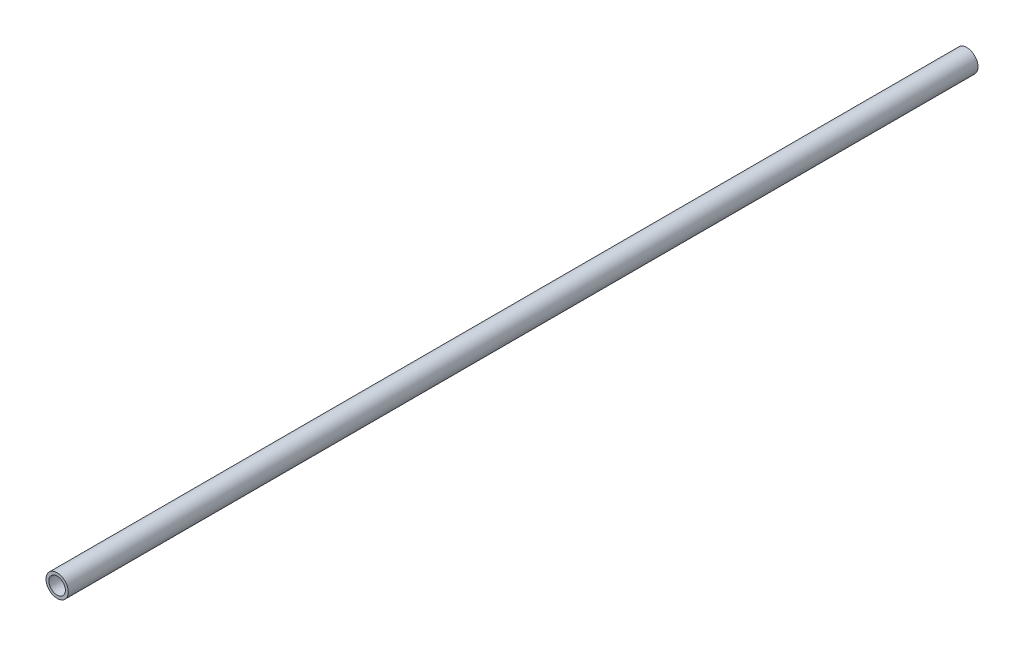
ISO-10303-21;
HEADER;
FILE_DESCRIPTION(('STEP AP214'),'2;1');
FILE_NAME('part.step','',(''),(''),'','','');
FILE_SCHEMA(('AUTOMOTIVE_DESIGN { 1 0 10303 214 1 1 1 1 }'));
ENDSEC;
DATA;
#1=APPLICATION_CONTEXT('core data for automotive mechanical design processes');
#2=APPLICATION_PROTOCOL_DEFINITION('international standard','automotive_design',2000,#1);
#3=PRODUCT_CONTEXT('',#1,'mechanical');
#4=PRODUCT('Part','Part','',(#3));
#5=PRODUCT_RELATED_PRODUCT_CATEGORY('part','',(#4));
#6=PRODUCT_DEFINITION_FORMATION('','',#4);
#7=PRODUCT_DEFINITION_CONTEXT('part definition',#1,'design');
#8=PRODUCT_DEFINITION('design','',#6,#7);
#9=PRODUCT_DEFINITION_SHAPE('','',#8);
#10=(LENGTH_UNIT() NAMED_UNIT(*) SI_UNIT(.MILLI.,.METRE.));
#11=(NAMED_UNIT(*) PLANE_ANGLE_UNIT() SI_UNIT($,.RADIAN.));
#12=(NAMED_UNIT(*) SI_UNIT($,.STERADIAN.) SOLID_ANGLE_UNIT());
#13=UNCERTAINTY_MEASURE_WITH_UNIT(LENGTH_MEASURE(1.E-05),#10,'distance_accuracy_value','');
#14=(GEOMETRIC_REPRESENTATION_CONTEXT(3) GLOBAL_UNCERTAINTY_ASSIGNED_CONTEXT((#13)) GLOBAL_UNIT_ASSIGNED_CONTEXT((#10,
#11,#12)) REPRESENTATION_CONTEXT('',''));
#15=CARTESIAN_POINT('',(0.,0.,0.));
#16=DIRECTION('',(0.,0.,1.));
#17=DIRECTION('',(1.,0.,0.));
#18=AXIS2_PLACEMENT_3D('',#15,#16,#17);
#19=CARTESIAN_POINT('',(0.,0.,435.));
#20=DIRECTION('',(0.,0.,1.));
#21=DIRECTION('',(1.,0.,0.));
#22=AXIS2_PLACEMENT_3D('',#19,#20,#21);
#23=PLANE('',#22);
#24=CARTESIAN_POINT('',(0.,0.,435.));
#25=DIRECTION('',(0.,0.,1.));
#26=DIRECTION('',(1.,0.,0.));
#27=AXIS2_PLACEMENT_3D('',#24,#25,#26);
#28=CIRCLE('',#27,10.668);
#29=CARTESIAN_POINT('',(10.668,0.,435.));
#30=VERTEX_POINT('',#29);
#31=EDGE_CURVE('E11',#30,#30,#28,.T.);
#32=ORIENTED_EDGE('',*,*,#31,.T.);
#33=EDGE_LOOP('',(#32));
#34=FACE_BOUND('',#33,.T.);
#35=CARTESIAN_POINT('',(0.,0.,435.));
#36=DIRECTION('',(0.,0.,1.));
#37=DIRECTION('',(1.,0.,0.));
#38=AXIS2_PLACEMENT_3D('',#35,#36,#37);
#39=CIRCLE('',#38,7.8994);
#40=CARTESIAN_POINT('',(7.8994,0.,435.));
#41=VERTEX_POINT('',#40);
#42=EDGE_CURVE('E48',#41,#41,#39,.T.);
#43=ORIENTED_EDGE('',*,*,#42,.F.);
#44=EDGE_LOOP('',(#43));
#45=FACE_BOUND('',#44,.T.);
#46=ADVANCED_FACE('F37',(#34,#45),#23,.T.);
#47=CARTESIAN_POINT('',(0.,0.,-435.));
#48=DIRECTION('',(0.,0.,1.));
#49=DIRECTION('',(1.,0.,0.));
#50=AXIS2_PLACEMENT_3D('',#47,#48,#49);
#51=PLANE('',#50);
#52=CARTESIAN_POINT('',(0.,0.,-435.));
#53=DIRECTION('',(0.,0.,1.));
#54=DIRECTION('',(1.,0.,0.));
#55=AXIS2_PLACEMENT_3D('',#52,#53,#54);
#56=CIRCLE('',#55,10.668);
#57=CARTESIAN_POINT('',(10.668,0.,-435.));
#58=VERTEX_POINT('',#57);
#59=EDGE_CURVE('E41',#58,#58,#56,.T.);
#60=ORIENTED_EDGE('',*,*,#59,.F.);
#61=EDGE_LOOP('',(#60));
#62=FACE_BOUND('',#61,.T.);
#63=CARTESIAN_POINT('',(0.,0.,-435.));
#64=DIRECTION('',(0.,0.,1.));
#65=DIRECTION('',(1.,0.,0.));
#66=AXIS2_PLACEMENT_3D('',#63,#64,#65);
#67=CIRCLE('',#66,7.8994);
#68=CARTESIAN_POINT('',(7.8994,0.,-435.));
#69=VERTEX_POINT('',#68);
#70=EDGE_CURVE('E50',#69,#69,#67,.T.);
#71=ORIENTED_EDGE('',*,*,#70,.T.);
#72=EDGE_LOOP('',(#71));
#73=FACE_BOUND('',#72,.T.);
#74=ADVANCED_FACE('F60',(#62,#73),#51,.F.);
#75=CARTESIAN_POINT('',(0.,0.,435.));
#76=DIRECTION('',(0.,0.,-1.));
#77=DIRECTION('',(-1.,0.,0.));
#78=AXIS2_PLACEMENT_3D('',#75,#76,#77);
#79=CYLINDRICAL_SURFACE('',#78,10.668);
#80=ORIENTED_EDGE('',*,*,#31,.F.);
#81=EDGE_LOOP('',(#80));
#82=FACE_BOUND('',#81,.T.);
#83=ORIENTED_EDGE('',*,*,#59,.T.);
#84=EDGE_LOOP('',(#83));
#85=FACE_BOUND('',#84,.T.);
#86=ADVANCED_FACE('F39',(#82,#85),#79,.T.);
#87=CARTESIAN_POINT('',(0.,0.,435.));
#88=DIRECTION('',(0.,0.,-1.));
#89=DIRECTION('',(-1.,0.,0.));
#90=AXIS2_PLACEMENT_3D('',#87,#88,#89);
#91=CYLINDRICAL_SURFACE('',#90,7.8994);
#92=ORIENTED_EDGE('',*,*,#42,.T.);
#93=EDGE_LOOP('',(#92));
#94=FACE_BOUND('',#93,.T.);
#95=ORIENTED_EDGE('',*,*,#70,.F.);
#96=EDGE_LOOP('',(#95));
#97=FACE_BOUND('',#96,.T.);
#98=ADVANCED_FACE('F56',(#94,#97),#91,.F.);
#99=CLOSED_SHELL('',(#46,#74,#86,#98));
#100=MANIFOLD_SOLID_BREP('B2',#99);
#101=ADVANCED_BREP_SHAPE_REPRESENTATION('',(#18,#100),#14);
#102=SHAPE_DEFINITION_REPRESENTATION(#9,#101);
ENDSEC;
END-ISO-10303-21;
